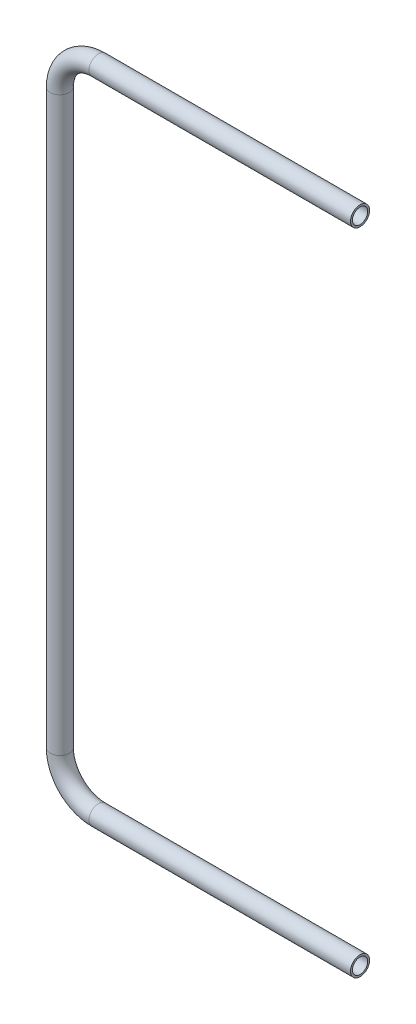
ISO-10303-21;
HEADER;
FILE_DESCRIPTION(('STEP AP214'),'2;1');
FILE_NAME('part.step','',(''),(''),'','','');
FILE_SCHEMA(('AUTOMOTIVE_DESIGN { 1 0 10303 214 1 1 1 1 }'));
ENDSEC;
DATA;
#1=APPLICATION_CONTEXT('core data for automotive mechanical design processes');
#2=APPLICATION_PROTOCOL_DEFINITION('international standard','automotive_design',2000,#1);
#3=PRODUCT_CONTEXT('',#1,'mechanical');
#4=PRODUCT('Part','Part','',(#3));
#5=PRODUCT_RELATED_PRODUCT_CATEGORY('part','',(#4));
#6=PRODUCT_DEFINITION_FORMATION('','',#4);
#7=PRODUCT_DEFINITION_CONTEXT('part definition',#1,'design');
#8=PRODUCT_DEFINITION('design','',#6,#7);
#9=PRODUCT_DEFINITION_SHAPE('','',#8);
#10=(LENGTH_UNIT() NAMED_UNIT(*) SI_UNIT(.MILLI.,.METRE.));
#11=(NAMED_UNIT(*) PLANE_ANGLE_UNIT() SI_UNIT($,.RADIAN.));
#12=(NAMED_UNIT(*) SI_UNIT($,.STERADIAN.) SOLID_ANGLE_UNIT());
#13=UNCERTAINTY_MEASURE_WITH_UNIT(LENGTH_MEASURE(1.E-05),#10,'distance_accuracy_value','');
#14=(GEOMETRIC_REPRESENTATION_CONTEXT(3) GLOBAL_UNCERTAINTY_ASSIGNED_CONTEXT((#13)) GLOBAL_UNIT_ASSIGNED_CONTEXT((#10,
#11,#12)) REPRESENTATION_CONTEXT('',''));
#15=CARTESIAN_POINT('',(0.,0.,0.));
#16=DIRECTION('',(0.,0.,1.));
#17=DIRECTION('',(1.,0.,0.));
#18=AXIS2_PLACEMENT_3D('',#15,#16,#17);
#19=CARTESIAN_POINT('',(0.,0.,0.));
#20=DIRECTION('',(-1.,0.,0.));
#21=DIRECTION('',(0.,-1.,0.));
#22=AXIS2_PLACEMENT_3D('',#19,#20,#21);
#23=CYLINDRICAL_SURFACE('',#22,16.7005);
#24=CARTESIAN_POINT('',(-457.2,0.,0.));
#25=DIRECTION('',(1.,0.,0.));
#26=DIRECTION('',(0.,0.,-1.));
#27=AXIS2_PLACEMENT_3D('',#24,#25,#26);
#28=CIRCLE('',#27,16.7005);
#29=CARTESIAN_POINT('',(-457.2,-16.7005000000001,0.));
#30=VERTEX_POINT('',#29);
#31=EDGE_CURVE('E111',#30,#30,#28,.T.);
#32=ORIENTED_EDGE('',*,*,#31,.T.);
#33=EDGE_LOOP('',(#32));
#34=FACE_BOUND('',#33,.T.);
#35=CARTESIAN_POINT('',(0.,0.,0.));
#36=DIRECTION('',(1.,0.,0.));
#37=DIRECTION('',(0.,0.,-1.));
#38=AXIS2_PLACEMENT_3D('',#35,#36,#37);
#39=CIRCLE('',#38,16.7005);
#40=CARTESIAN_POINT('',(0.,0.,-16.7005));
#41=VERTEX_POINT('',#40);
#42=EDGE_CURVE('E45',#41,#41,#39,.T.);
#43=ORIENTED_EDGE('',*,*,#42,.F.);
#44=EDGE_LOOP('',(#43));
#45=FACE_BOUND('',#44,.T.);
#46=ADVANCED_FACE('F30',(#34,#45),#23,.T.);
#47=CARTESIAN_POINT('',(-457.2,67.5005,0.));
#48=DIRECTION('',(0.,0.,-1.));
#49=DIRECTION('',(-1.,0.,0.));
#50=AXIS2_PLACEMENT_3D('',#47,#48,#49);
#51=TOROIDAL_SURFACE('',#50,67.5005,16.7005);
#52=CARTESIAN_POINT('',(-524.7005,67.5005,0.));
#53=DIRECTION('',(0.,-1.,0.));
#54=DIRECTION('',(0.,0.,-1.));
#55=AXIS2_PLACEMENT_3D('',#52,#53,#54);
#56=CIRCLE('',#55,16.7005);
#57=CARTESIAN_POINT('',(-541.401,67.5005,0.));
#58=VERTEX_POINT('',#57);
#59=EDGE_CURVE('E114',#58,#58,#56,.T.);
#60=CARTESIAN_POINT('',(-457.2,67.5005,0.));
#61=DIRECTION('',(0.,0.,-1.));
#62=DIRECTION('',(-1.,0.,0.));
#63=AXIS2_PLACEMENT_3D('',#60,#61,#62);
#64=CIRCLE('',#63,84.201);
#65=EDGE_CURVE('',#30,#58,#64,.T.);
#66=ORIENTED_EDGE('',*,*,#31,.F.);
#67=ORIENTED_EDGE('',*,*,#59,.T.);
#68=ORIENTED_EDGE('',*,*,#65,.T.);
#69=ORIENTED_EDGE('',*,*,#65,.F.);
#70=EDGE_LOOP('',(#66,#68,#67,#69));
#71=FACE_BOUND('',#70,.T.);
#72=ADVANCED_FACE('F135',(#71),#51,.T.);
#73=CARTESIAN_POINT('',(-524.7005,67.5005,0.));
#74=DIRECTION('',(0.,1.,0.));
#75=DIRECTION('',(-1.,0.,0.));
#76=AXIS2_PLACEMENT_3D('',#73,#74,#75);
#77=CYLINDRICAL_SURFACE('',#76,16.7005);
#78=CARTESIAN_POINT('',(-524.7005,1067.562,0.));
#79=DIRECTION('',(0.,-1.,0.));
#80=DIRECTION('',(0.,0.,-1.));
#81=AXIS2_PLACEMENT_3D('',#78,#79,#80);
#82=CIRCLE('',#81,16.7005);
#83=CARTESIAN_POINT('',(-541.401,1067.562,0.));
#84=VERTEX_POINT('',#83);
#85=EDGE_CURVE('E116',#84,#84,#82,.T.);
#86=ORIENTED_EDGE('',*,*,#85,.T.);
#87=EDGE_LOOP('',(#86));
#88=FACE_BOUND('',#87,.T.);
#89=ORIENTED_EDGE('',*,*,#59,.F.);
#90=EDGE_LOOP('',(#89));
#91=FACE_BOUND('',#90,.T.);
#92=ADVANCED_FACE('F131',(#88,#91),#77,.T.);
#93=CARTESIAN_POINT('',(-457.2,1067.562,0.));
#94=DIRECTION('',(0.,0.,-1.));
#95=DIRECTION('',(-1.,0.,0.));
#96=AXIS2_PLACEMENT_3D('',#93,#94,#95);
#97=TOROIDAL_SURFACE('',#96,67.5005,16.7005);
#98=CARTESIAN_POINT('',(-457.2,1135.0625,0.));
#99=DIRECTION('',(-1.,0.,0.));
#100=DIRECTION('',(0.,0.,-1.));
#101=AXIS2_PLACEMENT_3D('',#98,#99,#100);
#102=CIRCLE('',#101,16.7005);
#103=CARTESIAN_POINT('',(-457.2,1151.763,0.));
#104=VERTEX_POINT('',#103);
#105=EDGE_CURVE('E34',#104,#104,#102,.T.);
#106=CARTESIAN_POINT('',(-457.2,1067.562,0.));
#107=DIRECTION('',(0.,0.,-1.));
#108=DIRECTION('',(-1.,0.,0.));
#109=AXIS2_PLACEMENT_3D('',#106,#107,#108);
#110=CIRCLE('',#109,84.201);
#111=EDGE_CURVE('',#84,#104,#110,.T.);
#112=ORIENTED_EDGE('',*,*,#85,.F.);
#113=ORIENTED_EDGE('',*,*,#105,.T.);
#114=ORIENTED_EDGE('',*,*,#111,.T.);
#115=ORIENTED_EDGE('',*,*,#111,.F.);
#116=EDGE_LOOP('',(#112,#114,#113,#115));
#117=FACE_BOUND('',#116,.T.);
#118=ADVANCED_FACE('F123',(#117),#97,.T.);
#119=CARTESIAN_POINT('',(-457.2,1135.0625,0.));
#120=DIRECTION('',(1.,0.,0.));
#121=DIRECTION('',(0.,1.,0.));
#122=AXIS2_PLACEMENT_3D('',#119,#120,#121);
#123=CYLINDRICAL_SURFACE('',#122,16.7005);
#124=CARTESIAN_POINT('',(-3.33066907387547E-13,1135.0625,0.));
#125=DIRECTION('',(-1.,0.,0.));
#126=DIRECTION('',(0.,0.,-1.));
#127=AXIS2_PLACEMENT_3D('',#124,#125,#126);
#128=CIRCLE('',#127,16.7005);
#129=CARTESIAN_POINT('',(-3.33066907387547E-13,1135.0625,-16.7005));
#130=VERTEX_POINT('',#129);
#131=EDGE_CURVE('E50',#130,#130,#128,.T.);
#132=ORIENTED_EDGE('',*,*,#131,.T.);
#133=EDGE_LOOP('',(#132));
#134=FACE_BOUND('',#133,.T.);
#135=ORIENTED_EDGE('',*,*,#105,.F.);
#136=EDGE_LOOP('',(#135));
#137=FACE_BOUND('',#136,.T.);
#138=ADVANCED_FACE('F32',(#134,#137),#123,.T.);
#139=CARTESIAN_POINT('',(0.,0.,0.));
#140=DIRECTION('',(1.,0.,0.));
#141=DIRECTION('',(0.,0.,-1.));
#142=AXIS2_PLACEMENT_3D('',#139,#140,#141);
#143=PLANE('',#142);
#144=CARTESIAN_POINT('',(0.,0.,0.));
#145=DIRECTION('',(1.,0.,0.));
#146=DIRECTION('',(0.,0.,-1.));
#147=AXIS2_PLACEMENT_3D('',#144,#145,#146);
#148=CIRCLE('',#147,13.335);
#149=CARTESIAN_POINT('',(0.,0.,-13.335));
#150=VERTEX_POINT('',#149);
#151=EDGE_CURVE('E98',#150,#150,#148,.F.);
#152=ORIENTED_EDGE('',*,*,#151,.T.);
#153=EDGE_LOOP('',(#152));
#154=FACE_BOUND('',#153,.T.);
#155=ORIENTED_EDGE('',*,*,#42,.T.);
#156=EDGE_LOOP('',(#155));
#157=FACE_BOUND('',#156,.T.);
#158=ADVANCED_FACE('F63',(#154,#157),#143,.T.);
#159=CARTESIAN_POINT('',(-3.33066907387547E-13,1135.0625,0.));
#160=DIRECTION('',(-1.,0.,0.));
#161=DIRECTION('',(0.,0.,-1.));
#162=AXIS2_PLACEMENT_3D('',#159,#160,#161);
#163=PLANE('',#162);
#164=CARTESIAN_POINT('',(-3.33066907387547E-13,1135.0625,0.));
#165=DIRECTION('',(-1.,0.,0.));
#166=DIRECTION('',(0.,0.,-1.));
#167=AXIS2_PLACEMENT_3D('',#164,#165,#166);
#168=CIRCLE('',#167,13.335);
#169=CARTESIAN_POINT('',(-3.33066907387547E-13,1135.0625,-13.335));
#170=VERTEX_POINT('',#169);
#171=EDGE_CURVE('E11',#170,#170,#168,.F.);
#172=ORIENTED_EDGE('',*,*,#171,.F.);
#173=EDGE_LOOP('',(#172));
#174=FACE_BOUND('',#173,.T.);
#175=ORIENTED_EDGE('',*,*,#131,.F.);
#176=EDGE_LOOP('',(#175));
#177=FACE_BOUND('',#176,.T.);
#178=ADVANCED_FACE('F60',(#174,#177),#163,.F.);
#179=CARTESIAN_POINT('',(0.,0.,0.));
#180=DIRECTION('',(-1.,0.,0.));
#181=DIRECTION('',(0.,-1.,0.));
#182=AXIS2_PLACEMENT_3D('',#179,#180,#181);
#183=CYLINDRICAL_SURFACE('',#182,13.335);
#184=CARTESIAN_POINT('',(-457.2,0.,0.));
#185=DIRECTION('',(1.,0.,0.));
#186=DIRECTION('',(0.,0.,-1.));
#187=AXIS2_PLACEMENT_3D('',#184,#185,#186);
#188=CIRCLE('',#187,13.335);
#189=CARTESIAN_POINT('',(-457.2,-13.3350000000001,0.));
#190=VERTEX_POINT('',#189);
#191=EDGE_CURVE('E97',#190,#190,#188,.F.);
#192=ORIENTED_EDGE('',*,*,#191,.T.);
#193=EDGE_LOOP('',(#192));
#194=FACE_BOUND('',#193,.T.);
#195=ORIENTED_EDGE('',*,*,#151,.F.);
#196=EDGE_LOOP('',(#195));
#197=FACE_BOUND('',#196,.T.);
#198=ADVANCED_FACE('F62',(#194,#197),#183,.F.);
#199=CARTESIAN_POINT('',(-457.2,67.5005,0.));
#200=DIRECTION('',(0.,0.,-1.));
#201=DIRECTION('',(-1.,0.,0.));
#202=AXIS2_PLACEMENT_3D('',#199,#200,#201);
#203=TOROIDAL_SURFACE('',#202,67.5005,13.335);
#204=CARTESIAN_POINT('',(-524.7005,67.5005,0.));
#205=DIRECTION('',(0.,-1.,0.));
#206=DIRECTION('',(0.,0.,-1.));
#207=AXIS2_PLACEMENT_3D('',#204,#205,#206);
#208=CIRCLE('',#207,13.335);
#209=CARTESIAN_POINT('',(-538.0355,67.5005,0.));
#210=VERTEX_POINT('',#209);
#211=EDGE_CURVE('E94',#210,#210,#208,.F.);
#212=CARTESIAN_POINT('',(-457.2,67.5005,0.));
#213=DIRECTION('',(0.,0.,-1.));
#214=DIRECTION('',(-1.,0.,0.));
#215=AXIS2_PLACEMENT_3D('',#212,#213,#214);
#216=CIRCLE('',#215,80.8355);
#217=EDGE_CURVE('',#190,#210,#216,.T.);
#218=ORIENTED_EDGE('',*,*,#191,.F.);
#219=ORIENTED_EDGE('',*,*,#211,.T.);
#220=ORIENTED_EDGE('',*,*,#217,.T.);
#221=ORIENTED_EDGE('',*,*,#217,.F.);
#222=EDGE_LOOP('',(#218,#220,#219,#221));
#223=FACE_BOUND('',#222,.T.);
#224=ADVANCED_FACE('F69',(#223),#203,.F.);
#225=CARTESIAN_POINT('',(-524.7005,67.5005,0.));
#226=DIRECTION('',(0.,1.,0.));
#227=DIRECTION('',(-1.,0.,0.));
#228=AXIS2_PLACEMENT_3D('',#225,#226,#227);
#229=CYLINDRICAL_SURFACE('',#228,13.335);
#230=CARTESIAN_POINT('',(-524.7005,1067.562,0.));
#231=DIRECTION('',(0.,-1.,0.));
#232=DIRECTION('',(0.,0.,-1.));
#233=AXIS2_PLACEMENT_3D('',#230,#231,#232);
#234=CIRCLE('',#233,13.335);
#235=CARTESIAN_POINT('',(-538.0355,1067.562,0.));
#236=VERTEX_POINT('',#235);
#237=EDGE_CURVE('E100',#236,#236,#234,.F.);
#238=ORIENTED_EDGE('',*,*,#237,.T.);
#239=EDGE_LOOP('',(#238));
#240=FACE_BOUND('',#239,.T.);
#241=ORIENTED_EDGE('',*,*,#211,.F.);
#242=EDGE_LOOP('',(#241));
#243=FACE_BOUND('',#242,.T.);
#244=ADVANCED_FACE('F80',(#240,#243),#229,.F.);
#245=CARTESIAN_POINT('',(-457.2,1067.562,0.));
#246=DIRECTION('',(0.,0.,-1.));
#247=DIRECTION('',(-1.,0.,0.));
#248=AXIS2_PLACEMENT_3D('',#245,#246,#247);
#249=TOROIDAL_SURFACE('',#248,67.5005,13.335);
#250=CARTESIAN_POINT('',(-457.2,1135.0625,0.));
#251=DIRECTION('',(-1.,0.,0.));
#252=DIRECTION('',(0.,0.,-1.));
#253=AXIS2_PLACEMENT_3D('',#250,#251,#252);
#254=CIRCLE('',#253,13.335);
#255=CARTESIAN_POINT('',(-457.2,1148.3975,0.));
#256=VERTEX_POINT('',#255);
#257=EDGE_CURVE('E39',#256,#256,#254,.F.);
#258=CARTESIAN_POINT('',(-457.2,1067.562,0.));
#259=DIRECTION('',(0.,0.,-1.));
#260=DIRECTION('',(-1.,0.,0.));
#261=AXIS2_PLACEMENT_3D('',#258,#259,#260);
#262=CIRCLE('',#261,80.8355);
#263=EDGE_CURVE('',#236,#256,#262,.T.);
#264=ORIENTED_EDGE('',*,*,#237,.F.);
#265=ORIENTED_EDGE('',*,*,#257,.T.);
#266=ORIENTED_EDGE('',*,*,#263,.T.);
#267=ORIENTED_EDGE('',*,*,#263,.F.);
#268=EDGE_LOOP('',(#264,#266,#265,#267));
#269=FACE_BOUND('',#268,.T.);
#270=ADVANCED_FACE('F76',(#269),#249,.F.);
#271=CARTESIAN_POINT('',(-457.2,1135.0625,0.));
#272=DIRECTION('',(1.,0.,0.));
#273=DIRECTION('',(0.,1.,0.));
#274=AXIS2_PLACEMENT_3D('',#271,#272,#273);
#275=CYLINDRICAL_SURFACE('',#274,13.335);
#276=ORIENTED_EDGE('',*,*,#171,.T.);
#277=EDGE_LOOP('',(#276));
#278=FACE_BOUND('',#277,.T.);
#279=ORIENTED_EDGE('',*,*,#257,.F.);
#280=EDGE_LOOP('',(#279));
#281=FACE_BOUND('',#280,.T.);
#282=ADVANCED_FACE('F57',(#278,#281),#275,.F.);
#283=CLOSED_SHELL('',(#46,#72,#92,#118,#138,#158,#178,#198,#224,#244,#270,#282));
#284=MANIFOLD_SOLID_BREP('B2',#283);
#285=ADVANCED_BREP_SHAPE_REPRESENTATION('',(#18,#284),#14);
#286=SHAPE_DEFINITION_REPRESENTATION(#9,#285);
ENDSEC;
END-ISO-10303-21;
